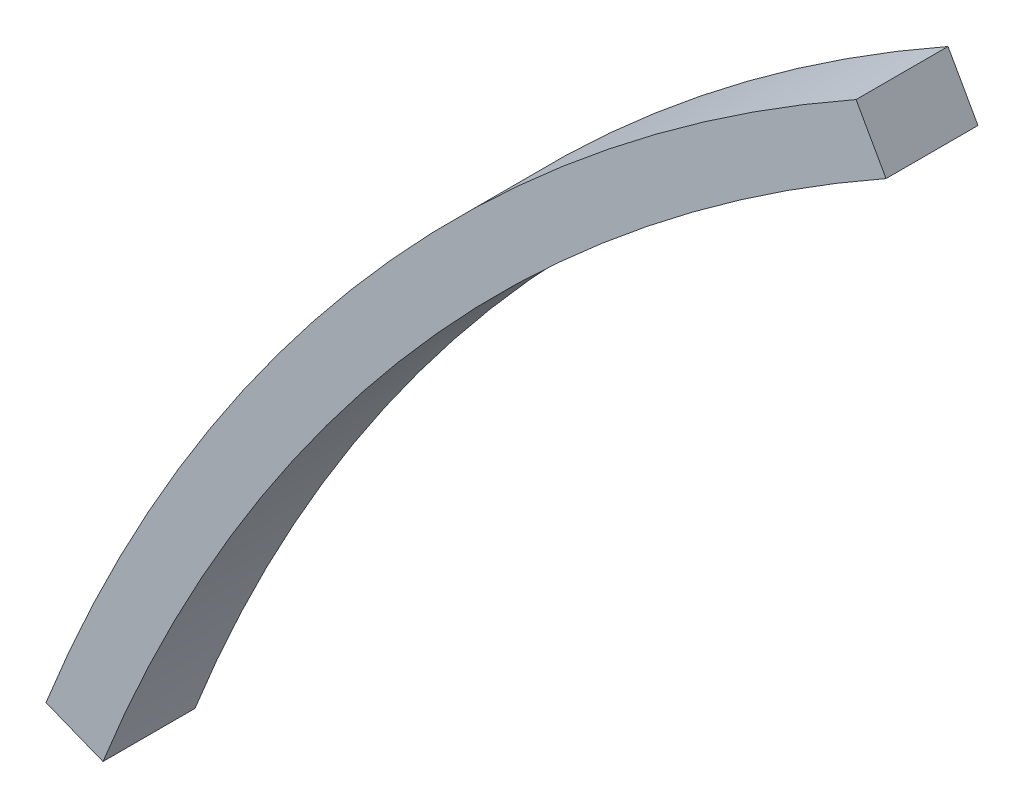
ISO-10303-21;
HEADER;
FILE_DESCRIPTION(('STEP AP214'),'2;1');
FILE_NAME('part.step','',(''),(''),'','','');
FILE_SCHEMA(('AUTOMOTIVE_DESIGN { 1 0 10303 214 1 1 1 1 }'));
ENDSEC;
DATA;
#1=APPLICATION_CONTEXT('core data for automotive mechanical design processes');
#2=APPLICATION_PROTOCOL_DEFINITION('international standard','automotive_design',2000,#1);
#3=PRODUCT_CONTEXT('',#1,'mechanical');
#4=PRODUCT('Part','Part','',(#3));
#5=PRODUCT_RELATED_PRODUCT_CATEGORY('part','',(#4));
#6=PRODUCT_DEFINITION_FORMATION('','',#4);
#7=PRODUCT_DEFINITION_CONTEXT('part definition',#1,'design');
#8=PRODUCT_DEFINITION('design','',#6,#7);
#9=PRODUCT_DEFINITION_SHAPE('','',#8);
#10=(LENGTH_UNIT() NAMED_UNIT(*) SI_UNIT(.MILLI.,.METRE.));
#11=(NAMED_UNIT(*) PLANE_ANGLE_UNIT() SI_UNIT($,.RADIAN.));
#12=(NAMED_UNIT(*) SI_UNIT($,.STERADIAN.) SOLID_ANGLE_UNIT());
#13=UNCERTAINTY_MEASURE_WITH_UNIT(LENGTH_MEASURE(1.E-05),#10,'distance_accuracy_value','');
#14=(GEOMETRIC_REPRESENTATION_CONTEXT(3) GLOBAL_UNCERTAINTY_ASSIGNED_CONTEXT((#13)) GLOBAL_UNIT_ASSIGNED_CONTEXT((#10,
#11,#12)) REPRESENTATION_CONTEXT('',''));
#15=CARTESIAN_POINT('',(0.,0.,0.));
#16=DIRECTION('',(0.,0.,1.));
#17=DIRECTION('',(1.,0.,0.));
#18=AXIS2_PLACEMENT_3D('',#15,#16,#17);
#19=CARTESIAN_POINT('',(0.,0.,3.));
#20=DIRECTION('',(0.,0.,-1.));
#21=DIRECTION('',(-1.,0.,0.));
#22=AXIS2_PLACEMENT_3D('',#19,#20,#21);
#23=CYLINDRICAL_SURFACE('',#22,58.);
#24=CARTESIAN_POINT('',(0.,0.,0.));
#25=DIRECTION('',(0.,0.,-1.));
#26=DIRECTION('',(1.,0.,0.));
#27=AXIS2_PLACEMENT_3D('',#24,#25,#26);
#28=CIRCLE('',#27,58.);
#29=CARTESIAN_POINT('',(-53.9345207701032,21.3323104538468,0.));
#30=VERTEX_POINT('',#29);
#31=CARTESIAN_POINT('',(-28.3842649295451,50.5799713761227,0.));
#32=VERTEX_POINT('',#31);
#33=EDGE_CURVE('E95',#30,#32,#28,.T.);
#34=ORIENTED_EDGE('',*,*,#33,.T.);
#35=DIRECTION('',(0.,0.,-1.));
#36=VECTOR('',#35,1.);
#37=CARTESIAN_POINT('',(-28.3842649295451,50.5799713761227,3.));
#38=LINE('',#37,#36);
#39=CARTESIAN_POINT('',(-28.3842649295451,50.5799713761227,3.));
#40=VERTEX_POINT('',#39);
#41=EDGE_CURVE('E11',#40,#32,#38,.T.);
#42=ORIENTED_EDGE('',*,*,#41,.F.);
#43=CARTESIAN_POINT('',(0.,0.,3.));
#44=DIRECTION('',(0.,0.,-1.));
#45=DIRECTION('',(1.,0.,0.));
#46=AXIS2_PLACEMENT_3D('',#43,#44,#45);
#47=CIRCLE('',#46,58.);
#48=CARTESIAN_POINT('',(-53.9345207701032,21.3323104538468,3.));
#49=VERTEX_POINT('',#48);
#50=EDGE_CURVE('E83',#49,#40,#47,.T.);
#51=ORIENTED_EDGE('',*,*,#50,.F.);
#52=DIRECTION('',(0.,0.,-1.));
#53=VECTOR('',#52,1.);
#54=CARTESIAN_POINT('',(-53.9345207701032,21.3323104538468,3.));
#55=LINE('',#54,#53);
#56=EDGE_CURVE('E91',#49,#30,#55,.T.);
#57=ORIENTED_EDGE('',*,*,#56,.T.);
#58=EDGE_LOOP('',(#34,#42,#51,#57));
#59=FACE_BOUND('',#58,.T.);
#60=ADVANCED_FACE('F32',(#59),#23,.F.);
#61=CARTESIAN_POINT('',(-28.3842649295451,50.5799713761227,3.));
#62=DIRECTION('',(-0.872068472002115,-0.489383878095606,0.));
#63=DIRECTION('',(0.489383878095607,-0.872068472002116,0.));
#64=AXIS2_PLACEMENT_3D('',#61,#62,#63);
#65=PLANE('',#64);
#66=DIRECTION('',(-0.489383878095606,0.872068472002116,0.));
#67=VECTOR('',#66,1.);
#68=CARTESIAN_POINT('',(-28.3842649295451,50.5799713761227,0.));
#69=LINE('',#68,#67);
#70=CARTESIAN_POINT('',(-29.3630326857363,52.324108320127,0.));
#71=VERTEX_POINT('',#70);
#72=EDGE_CURVE('E87',#32,#71,#69,.T.);
#73=ORIENTED_EDGE('',*,*,#72,.T.);
#74=DIRECTION('',(0.,0.,-1.));
#75=VECTOR('',#74,1.);
#76=CARTESIAN_POINT('',(-29.3630326857363,52.324108320127,3.));
#77=LINE('',#76,#75);
#78=CARTESIAN_POINT('',(-29.3630326857363,52.324108320127,3.));
#79=VERTEX_POINT('',#78);
#80=EDGE_CURVE('E40',#79,#71,#77,.T.);
#81=ORIENTED_EDGE('',*,*,#80,.F.);
#82=DIRECTION('',(-0.489383878095606,0.872068472002116,0.));
#83=VECTOR('',#82,1.);
#84=CARTESIAN_POINT('',(-28.3842649295451,50.5799713761227,3.));
#85=LINE('',#84,#83);
#86=EDGE_CURVE('E78',#40,#79,#85,.T.);
#87=ORIENTED_EDGE('',*,*,#86,.F.);
#88=ORIENTED_EDGE('',*,*,#41,.T.);
#89=EDGE_LOOP('',(#73,#81,#87,#88));
#90=FACE_BOUND('',#89,.T.);
#91=ADVANCED_FACE('F86',(#90),#65,.F.);
#92=CARTESIAN_POINT('',(0.,0.,3.));
#93=DIRECTION('',(0.,0.,-1.));
#94=DIRECTION('',(-1.,0.,0.));
#95=AXIS2_PLACEMENT_3D('',#92,#93,#94);
#96=CYLINDRICAL_SURFACE('',#95,60.);
#97=CARTESIAN_POINT('',(0.,0.,0.));
#98=DIRECTION('',(0.,0.,1.));
#99=DIRECTION('',(1.,0.,0.));
#100=AXIS2_PLACEMENT_3D('',#97,#98,#99);
#101=CIRCLE('',#100,60.);
#102=CARTESIAN_POINT('',(-55.7943318311413,22.0679073660484,0.));
#103=VERTEX_POINT('',#102);
#104=EDGE_CURVE('E65',#71,#103,#101,.T.);
#105=ORIENTED_EDGE('',*,*,#104,.T.);
#106=DIRECTION('',(0.,0.,-1.));
#107=VECTOR('',#106,1.);
#108=CARTESIAN_POINT('',(-55.7943318311413,22.0679073660484,3.));
#109=LINE('',#108,#107);
#110=CARTESIAN_POINT('',(-55.7943318311413,22.0679073660484,3.));
#111=VERTEX_POINT('',#110);
#112=EDGE_CURVE('E88',#111,#103,#109,.T.);
#113=ORIENTED_EDGE('',*,*,#112,.F.);
#114=CARTESIAN_POINT('',(0.,0.,3.));
#115=DIRECTION('',(0.,0.,1.));
#116=DIRECTION('',(1.,0.,0.));
#117=AXIS2_PLACEMENT_3D('',#114,#115,#116);
#118=CIRCLE('',#117,60.);
#119=EDGE_CURVE('E81',#79,#111,#118,.T.);
#120=ORIENTED_EDGE('',*,*,#119,.F.);
#121=ORIENTED_EDGE('',*,*,#80,.T.);
#122=EDGE_LOOP('',(#105,#113,#120,#121));
#123=FACE_BOUND('',#122,.T.);
#124=ADVANCED_FACE('F89',(#123),#96,.T.);
#125=CARTESIAN_POINT('',(-53.9345207701032,21.3323104538468,3.));
#126=DIRECTION('',(0.367798456100806,0.929905530519022,0.));
#127=DIRECTION('',(-0.929905530519022,0.367798456100806,0.));
#128=AXIS2_PLACEMENT_3D('',#125,#126,#127);
#129=PLANE('',#128);
#130=DIRECTION('',(0.929905530519022,-0.367798456100806,0.));
#131=VECTOR('',#130,1.);
#132=CARTESIAN_POINT('',(-53.9345207701032,21.3323104538468,0.));
#133=LINE('',#132,#131);
#134=EDGE_CURVE('E71',#103,#30,#133,.T.);
#135=ORIENTED_EDGE('',*,*,#134,.T.);
#136=ORIENTED_EDGE('',*,*,#56,.F.);
#137=DIRECTION('',(0.929905530519022,-0.367798456100806,0.));
#138=VECTOR('',#137,1.);
#139=CARTESIAN_POINT('',(-53.9345207701032,21.3323104538468,3.));
#140=LINE('',#139,#138);
#141=EDGE_CURVE('E48',#111,#49,#140,.T.);
#142=ORIENTED_EDGE('',*,*,#141,.F.);
#143=ORIENTED_EDGE('',*,*,#112,.T.);
#144=EDGE_LOOP('',(#135,#136,#142,#143));
#145=FACE_BOUND('',#144,.T.);
#146=ADVANCED_FACE('F102',(#145),#129,.F.);
#147=CARTESIAN_POINT('',(0.,0.,3.));
#148=DIRECTION('',(0.,0.,1.));
#149=DIRECTION('',(1.,0.,0.));
#150=AXIS2_PLACEMENT_3D('',#147,#148,#149);
#151=PLANE('',#150);
#152=ORIENTED_EDGE('',*,*,#50,.T.);
#153=ORIENTED_EDGE('',*,*,#86,.T.);
#154=ORIENTED_EDGE('',*,*,#119,.T.);
#155=ORIENTED_EDGE('',*,*,#141,.T.);
#156=EDGE_LOOP('',(#152,#153,#154,#155));
#157=FACE_BOUND('',#156,.T.);
#158=ADVANCED_FACE('F79',(#157),#151,.T.);
#159=CARTESIAN_POINT('',(0.,0.,0.));
#160=DIRECTION('',(0.,0.,1.));
#161=DIRECTION('',(1.,0.,0.));
#162=AXIS2_PLACEMENT_3D('',#159,#160,#161);
#163=PLANE('',#162);
#164=ORIENTED_EDGE('',*,*,#33,.F.);
#165=ORIENTED_EDGE('',*,*,#134,.F.);
#166=ORIENTED_EDGE('',*,*,#104,.F.);
#167=ORIENTED_EDGE('',*,*,#72,.F.);
#168=EDGE_LOOP('',(#164,#165,#166,#167));
#169=FACE_BOUND('',#168,.T.);
#170=ADVANCED_FACE('F105',(#169),#163,.F.);
#171=CLOSED_SHELL('',(#60,#91,#124,#146,#158,#170));
#172=MANIFOLD_SOLID_BREP('B2',#171);
#173=ADVANCED_BREP_SHAPE_REPRESENTATION('',(#18,#172),#14);
#174=SHAPE_DEFINITION_REPRESENTATION(#9,#173);
ENDSEC;
END-ISO-10303-21;
